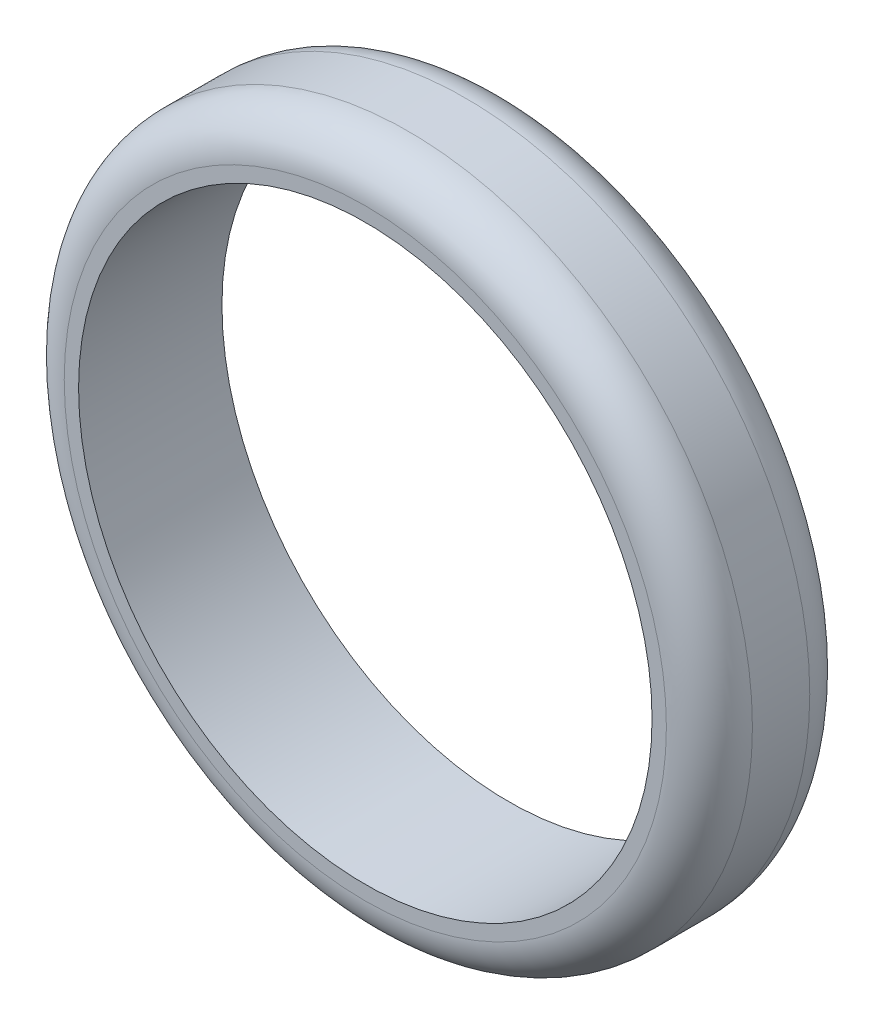
ISO-10303-21;
HEADER;
FILE_DESCRIPTION(('STEP AP214'),'2;1');
FILE_NAME('part.step','',(''),(''),'','','');
FILE_SCHEMA(('AUTOMOTIVE_DESIGN { 1 0 10303 214 1 1 1 1 }'));
ENDSEC;
DATA;
#1=APPLICATION_CONTEXT('core data for automotive mechanical design processes');
#2=APPLICATION_PROTOCOL_DEFINITION('international standard','automotive_design',2000,#1);
#3=PRODUCT_CONTEXT('',#1,'mechanical');
#4=PRODUCT('Part','Part','',(#3));
#5=PRODUCT_RELATED_PRODUCT_CATEGORY('part','',(#4));
#6=PRODUCT_DEFINITION_FORMATION('','',#4);
#7=PRODUCT_DEFINITION_CONTEXT('part definition',#1,'design');
#8=PRODUCT_DEFINITION('design','',#6,#7);
#9=PRODUCT_DEFINITION_SHAPE('','',#8);
#10=(LENGTH_UNIT() NAMED_UNIT(*) SI_UNIT(.MILLI.,.METRE.));
#11=(NAMED_UNIT(*) PLANE_ANGLE_UNIT() SI_UNIT($,.RADIAN.));
#12=(NAMED_UNIT(*) SI_UNIT($,.STERADIAN.) SOLID_ANGLE_UNIT());
#13=UNCERTAINTY_MEASURE_WITH_UNIT(LENGTH_MEASURE(1.E-05),#10,'distance_accuracy_value','');
#14=(GEOMETRIC_REPRESENTATION_CONTEXT(3) GLOBAL_UNCERTAINTY_ASSIGNED_CONTEXT((#13)) GLOBAL_UNIT_ASSIGNED_CONTEXT((#10,
#11,#12)) REPRESENTATION_CONTEXT('',''));
#15=CARTESIAN_POINT('',(0.,0.,0.));
#16=DIRECTION('',(0.,0.,1.));
#17=DIRECTION('',(1.,0.,0.));
#18=AXIS2_PLACEMENT_3D('',#15,#16,#17);
#19=CARTESIAN_POINT('',(0.,0.,25.));
#20=DIRECTION('',(0.,0.,-1.));
#21=DIRECTION('',(-1.,0.,0.));
#22=AXIS2_PLACEMENT_3D('',#19,#20,#21);
#23=CYLINDRICAL_SURFACE('',#22,120.);
#24=CARTESIAN_POINT('',(0.,0.,10.));
#25=DIRECTION('',(0.,0.,1.));
#26=DIRECTION('',(1.,0.,0.));
#27=AXIS2_PLACEMENT_3D('',#24,#25,#26);
#28=CIRCLE('',#27,120.);
#29=CARTESIAN_POINT('',(120.,0.,10.));
#30=VERTEX_POINT('',#29);
#31=EDGE_CURVE('E10',#30,#30,#28,.F.);
#32=ORIENTED_EDGE('',*,*,#31,.T.);
#33=EDGE_LOOP('',(#32));
#34=FACE_BOUND('',#33,.T.);
#35=CARTESIAN_POINT('',(0.,0.,-10.));
#36=DIRECTION('',(0.,0.,1.));
#37=DIRECTION('',(1.,0.,0.));
#38=AXIS2_PLACEMENT_3D('',#35,#36,#37);
#39=CIRCLE('',#38,120.);
#40=CARTESIAN_POINT('',(120.,0.,-10.));
#41=VERTEX_POINT('',#40);
#42=EDGE_CURVE('E38',#41,#41,#39,.T.);
#43=ORIENTED_EDGE('',*,*,#42,.T.);
#44=EDGE_LOOP('',(#43));
#45=FACE_BOUND('',#44,.T.);
#46=ADVANCED_FACE('F15',(#34,#45),#23,.T.);
#47=CARTESIAN_POINT('',(0.,0.,25.));
#48=DIRECTION('',(0.,0.,1.));
#49=DIRECTION('',(1.,0.,0.));
#50=AXIS2_PLACEMENT_3D('',#47,#48,#49);
#51=PLANE('',#50);
#52=CARTESIAN_POINT('',(0.,0.,25.));
#53=DIRECTION('',(0.,0.,1.));
#54=DIRECTION('',(1.,0.,0.));
#55=AXIS2_PLACEMENT_3D('',#52,#53,#54);
#56=CIRCLE('',#55,100.);
#57=CARTESIAN_POINT('',(100.,0.,25.));
#58=VERTEX_POINT('',#57);
#59=EDGE_CURVE('E44',#58,#58,#56,.F.);
#60=ORIENTED_EDGE('',*,*,#59,.T.);
#61=EDGE_LOOP('',(#60));
#62=FACE_BOUND('',#61,.T.);
#63=CARTESIAN_POINT('',(0.,0.,25.));
#64=DIRECTION('',(0.,0.,1.));
#65=DIRECTION('',(1.,0.,0.));
#66=AXIS2_PLACEMENT_3D('',#63,#64,#65);
#67=CIRCLE('',#66,105.);
#68=CARTESIAN_POINT('',(105.,0.,25.));
#69=VERTEX_POINT('',#68);
#70=EDGE_CURVE('E23',#69,#69,#67,.T.);
#71=ORIENTED_EDGE('',*,*,#70,.T.);
#72=EDGE_LOOP('',(#71));
#73=FACE_BOUND('',#72,.T.);
#74=ADVANCED_FACE('F61',(#62,#73),#51,.T.);
#75=CARTESIAN_POINT('',(0.,0.,-25.));
#76=DIRECTION('',(0.,0.,1.));
#77=DIRECTION('',(1.,0.,0.));
#78=AXIS2_PLACEMENT_3D('',#75,#76,#77);
#79=PLANE('',#78);
#80=CARTESIAN_POINT('',(0.,0.,-25.));
#81=DIRECTION('',(0.,0.,-1.));
#82=DIRECTION('',(-1.,0.,0.));
#83=AXIS2_PLACEMENT_3D('',#80,#81,#82);
#84=CIRCLE('',#83,100.);
#85=CARTESIAN_POINT('',(-100.,0.,-25.));
#86=VERTEX_POINT('',#85);
#87=EDGE_CURVE('E48',#86,#86,#84,.T.);
#88=ORIENTED_EDGE('',*,*,#87,.F.);
#89=EDGE_LOOP('',(#88));
#90=FACE_BOUND('',#89,.T.);
#91=CARTESIAN_POINT('',(0.,0.,-25.));
#92=DIRECTION('',(0.,0.,1.));
#93=DIRECTION('',(1.,0.,0.));
#94=AXIS2_PLACEMENT_3D('',#91,#92,#93);
#95=CIRCLE('',#94,105.);
#96=CARTESIAN_POINT('',(105.,0.,-25.));
#97=VERTEX_POINT('',#96);
#98=EDGE_CURVE('E31',#97,#97,#95,.F.);
#99=ORIENTED_EDGE('',*,*,#98,.T.);
#100=EDGE_LOOP('',(#99));
#101=FACE_BOUND('',#100,.T.);
#102=ADVANCED_FACE('F57',(#90,#101),#79,.F.);
#103=CARTESIAN_POINT('',(0.,0.,-10.));
#104=DIRECTION('',(0.,0.,1.));
#105=DIRECTION('',(1.,0.,0.));
#106=AXIS2_PLACEMENT_3D('',#103,#104,#105);
#107=TOROIDAL_SURFACE('',#106,105.,15.);
#108=ORIENTED_EDGE('',*,*,#98,.F.);
#109=EDGE_LOOP('',(#108));
#110=FACE_BOUND('',#109,.T.);
#111=ORIENTED_EDGE('',*,*,#42,.F.);
#112=EDGE_LOOP('',(#111));
#113=FACE_BOUND('',#112,.T.);
#114=ADVANCED_FACE('F60',(#110,#113),#107,.T.);
#115=CARTESIAN_POINT('',(0.,0.,10.));
#116=DIRECTION('',(0.,0.,1.));
#117=DIRECTION('',(1.,0.,0.));
#118=AXIS2_PLACEMENT_3D('',#115,#116,#117);
#119=TOROIDAL_SURFACE('',#118,105.,15.);
#120=ORIENTED_EDGE('',*,*,#31,.F.);
#121=EDGE_LOOP('',(#120));
#122=FACE_BOUND('',#121,.T.);
#123=ORIENTED_EDGE('',*,*,#70,.F.);
#124=EDGE_LOOP('',(#123));
#125=FACE_BOUND('',#124,.T.);
#126=ADVANCED_FACE('F17',(#122,#125),#119,.T.);
#127=CARTESIAN_POINT('',(0.,0.,348.117366919547));
#128=DIRECTION('',(0.,0.,-1.));
#129=DIRECTION('',(-1.,0.,0.));
#130=AXIS2_PLACEMENT_3D('',#127,#128,#129);
#131=CYLINDRICAL_SURFACE('',#130,100.);
#132=ORIENTED_EDGE('',*,*,#59,.F.);
#133=EDGE_LOOP('',(#132));
#134=FACE_BOUND('',#133,.T.);
#135=ORIENTED_EDGE('',*,*,#87,.T.);
#136=EDGE_LOOP('',(#135));
#137=FACE_BOUND('',#136,.T.);
#138=ADVANCED_FACE('F55',(#134,#137),#131,.F.);
#139=CLOSED_SHELL('',(#46,#74,#102,#114,#126,#138));
#140=MANIFOLD_SOLID_BREP('B1',#139);
#141=ADVANCED_BREP_SHAPE_REPRESENTATION('',(#18,#140),#14);
#142=SHAPE_DEFINITION_REPRESENTATION(#9,#141);
ENDSEC;
END-ISO-10303-21;
